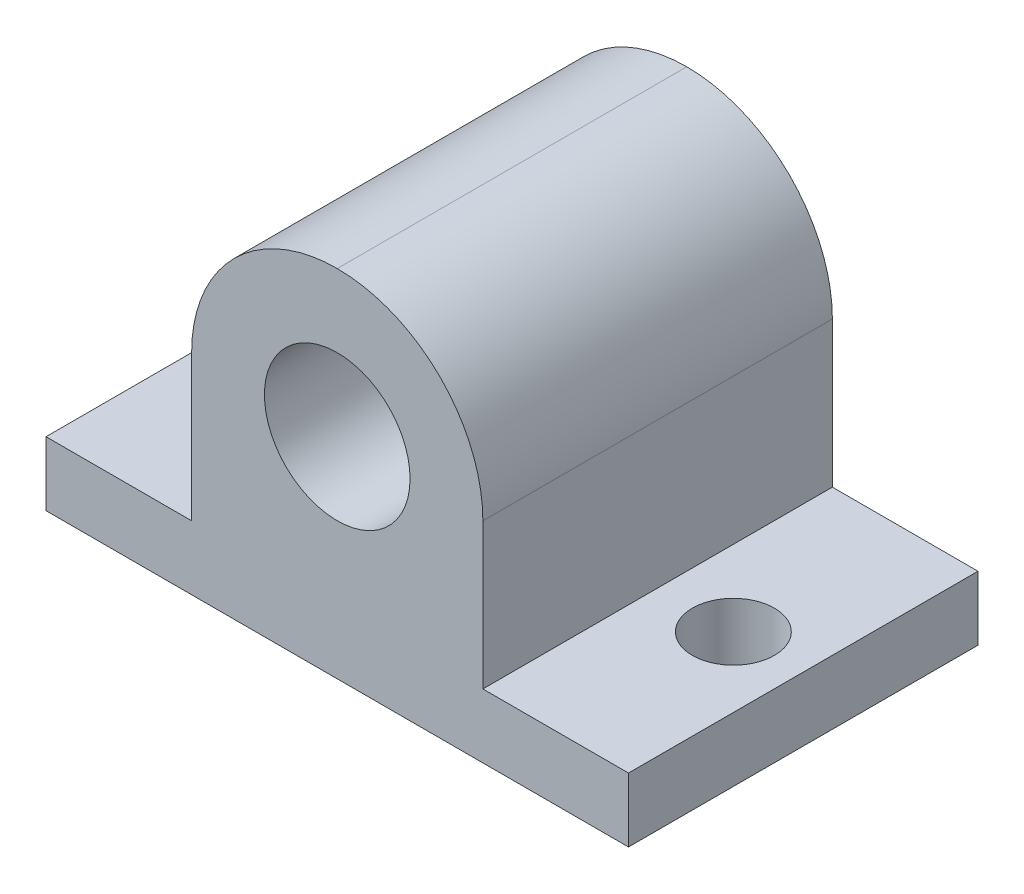
ISO-10303-21;
HEADER;
FILE_DESCRIPTION(('STEP AP214'),'2;1');
FILE_NAME('part.step','',(''),(''),'','','');
FILE_SCHEMA(('AUTOMOTIVE_DESIGN { 1 0 10303 214 1 1 1 1 }'));
ENDSEC;
DATA;
#1=APPLICATION_CONTEXT('core data for automotive mechanical design processes');
#2=APPLICATION_PROTOCOL_DEFINITION('international standard','automotive_design',2000,#1);
#3=PRODUCT_CONTEXT('',#1,'mechanical');
#4=PRODUCT('Part','Part','',(#3));
#5=PRODUCT_RELATED_PRODUCT_CATEGORY('part','',(#4));
#6=PRODUCT_DEFINITION_FORMATION('','',#4);
#7=PRODUCT_DEFINITION_CONTEXT('part definition',#1,'design');
#8=PRODUCT_DEFINITION('design','',#6,#7);
#9=PRODUCT_DEFINITION_SHAPE('','',#8);
#10=(LENGTH_UNIT() NAMED_UNIT(*) SI_UNIT(.MILLI.,.METRE.));
#11=(NAMED_UNIT(*) PLANE_ANGLE_UNIT() SI_UNIT($,.RADIAN.));
#12=(NAMED_UNIT(*) SI_UNIT($,.STERADIAN.) SOLID_ANGLE_UNIT());
#13=UNCERTAINTY_MEASURE_WITH_UNIT(LENGTH_MEASURE(1.E-05),#10,'distance_accuracy_value','');
#14=(GEOMETRIC_REPRESENTATION_CONTEXT(3) GLOBAL_UNCERTAINTY_ASSIGNED_CONTEXT((#13)) GLOBAL_UNIT_ASSIGNED_CONTEXT((#10,
#11,#12)) REPRESENTATION_CONTEXT('',''));
#15=CARTESIAN_POINT('',(0.,0.,0.));
#16=DIRECTION('',(0.,0.,1.));
#17=DIRECTION('',(1.,0.,0.));
#18=AXIS2_PLACEMENT_3D('',#15,#16,#17);
#19=CARTESIAN_POINT('',(0.,2.794,0.));
#20=DIRECTION('',(0.,-1.,0.));
#21=DIRECTION('',(0.,0.,-1.));
#22=AXIS2_PLACEMENT_3D('',#19,#20,#21);
#23=PLANE('',#22);
#24=CARTESIAN_POINT('',(3.04799999999999,2.794,-7.62));
#25=DIRECTION('',(0.,1.,0.));
#26=DIRECTION('',(0.,0.,1.));
#27=AXIS2_PLACEMENT_3D('',#24,#25,#26);
#28=CIRCLE('',#27,1.78754060407221);
#29=CARTESIAN_POINT('',(3.04799999999999,2.794,-5.83245939592779));
#30=VERTEX_POINT('',#29);
#31=EDGE_CURVE('E249',#30,#30,#28,.T.);
#32=ORIENTED_EDGE('',*,*,#31,.F.);
#33=EDGE_LOOP('',(#32));
#34=FACE_BOUND('',#33,.T.);
#35=DIRECTION('',(0.,0.,1.));
#36=VECTOR('',#35,1.);
#37=CARTESIAN_POINT('',(6.34999999999999,2.794,-15.24));
#38=LINE('',#37,#36);
#39=CARTESIAN_POINT('',(6.34999999999999,2.794,-15.24));
#40=VERTEX_POINT('',#39);
#41=CARTESIAN_POINT('',(6.34999999999999,2.794,0.));
#42=VERTEX_POINT('',#41);
#43=EDGE_CURVE('E133',#40,#42,#38,.T.);
#44=ORIENTED_EDGE('',*,*,#43,.F.);
#45=DIRECTION('',(-1.,0.,0.));
#46=VECTOR('',#45,1.);
#47=CARTESIAN_POINT('',(0.,2.794,-15.24));
#48=LINE('',#47,#46);
#49=CARTESIAN_POINT('',(0.,2.794,-15.24));
#50=VERTEX_POINT('',#49);
#51=EDGE_CURVE('E128',#40,#50,#48,.T.);
#52=ORIENTED_EDGE('',*,*,#51,.T.);
#53=DIRECTION('',(0.,0.,1.));
#54=VECTOR('',#53,1.);
#55=CARTESIAN_POINT('',(0.,2.794,0.));
#56=LINE('',#55,#54);
#57=CARTESIAN_POINT('',(0.,2.794,0.));
#58=VERTEX_POINT('',#57);
#59=EDGE_CURVE('E148',#50,#58,#56,.T.);
#60=ORIENTED_EDGE('',*,*,#59,.T.);
#61=DIRECTION('',(1.,0.,0.));
#62=VECTOR('',#61,1.);
#63=CARTESIAN_POINT('',(0.,2.794,0.));
#64=LINE('',#63,#62);
#65=EDGE_CURVE('E154',#58,#42,#64,.T.);
#66=ORIENTED_EDGE('',*,*,#65,.T.);
#67=EDGE_LOOP('',(#44,#52,#60,#66));
#68=FACE_BOUND('',#67,.T.);
#69=ADVANCED_FACE('F39',(#34,#68),#23,.F.);
#70=CARTESIAN_POINT('',(22.352,2.794,-7.62));
#71=DIRECTION('',(0.,1.,0.));
#72=DIRECTION('',(0.,0.,1.));
#73=AXIS2_PLACEMENT_3D('',#70,#71,#72);
#74=CIRCLE('',#73,1.78754060407221);
#75=CARTESIAN_POINT('',(22.352,2.794,-5.83245939592779));
#76=VERTEX_POINT('',#75);
#77=EDGE_CURVE('E241',#76,#76,#74,.T.);
#78=ORIENTED_EDGE('',*,*,#77,.F.);
#79=EDGE_LOOP('',(#78));
#80=FACE_BOUND('',#79,.T.);
#81=DIRECTION('',(0.,0.,-1.));
#82=VECTOR('',#81,1.);
#83=CARTESIAN_POINT('',(19.05,2.794,-15.24));
#84=LINE('',#83,#82);
#85=CARTESIAN_POINT('',(19.05,2.794,0.));
#86=VERTEX_POINT('',#85);
#87=CARTESIAN_POINT('',(19.05,2.794,-15.24));
#88=VERTEX_POINT('',#87);
#89=EDGE_CURVE('E121',#86,#88,#84,.T.);
#90=ORIENTED_EDGE('',*,*,#89,.F.);
#91=CARTESIAN_POINT('',(25.4,2.794,0.));
#92=VERTEX_POINT('',#91);
#93=EDGE_CURVE('E152',#86,#92,#64,.T.);
#94=ORIENTED_EDGE('',*,*,#93,.T.);
#95=DIRECTION('',(0.,0.,-1.));
#96=VECTOR('',#95,1.);
#97=CARTESIAN_POINT('',(25.4,2.794,0.));
#98=LINE('',#97,#96);
#99=CARTESIAN_POINT('',(25.4,2.794,-15.24));
#100=VERTEX_POINT('',#99);
#101=EDGE_CURVE('E124',#92,#100,#98,.T.);
#102=ORIENTED_EDGE('',*,*,#101,.T.);
#103=EDGE_CURVE('E110',#100,#88,#48,.T.);
#104=ORIENTED_EDGE('',*,*,#103,.T.);
#105=EDGE_LOOP('',(#90,#94,#102,#104));
#106=FACE_BOUND('',#105,.T.);
#107=ADVANCED_FACE('F120',(#80,#106),#23,.F.);
#108=CARTESIAN_POINT('',(0.,2.794,0.));
#109=DIRECTION('',(1.,0.,0.));
#110=DIRECTION('',(0.,0.,-1.));
#111=AXIS2_PLACEMENT_3D('',#108,#109,#110);
#112=PLANE('',#111);
#113=DIRECTION('',(0.,0.,1.));
#114=VECTOR('',#113,1.);
#115=CARTESIAN_POINT('',(0.,0.,0.));
#116=LINE('',#115,#114);
#117=CARTESIAN_POINT('',(0.,0.,-15.24));
#118=VERTEX_POINT('',#117);
#119=CARTESIAN_POINT('',(0.,0.,0.));
#120=VERTEX_POINT('',#119);
#121=EDGE_CURVE('E147',#118,#120,#116,.T.);
#122=ORIENTED_EDGE('',*,*,#121,.T.);
#123=DIRECTION('',(0.,-1.,0.));
#124=VECTOR('',#123,1.);
#125=CARTESIAN_POINT('',(0.,2.794,0.));
#126=LINE('',#125,#124);
#127=EDGE_CURVE('E181',#58,#120,#126,.T.);
#128=ORIENTED_EDGE('',*,*,#127,.F.);
#129=ORIENTED_EDGE('',*,*,#59,.F.);
#130=DIRECTION('',(0.,-1.,0.));
#131=VECTOR('',#130,1.);
#132=CARTESIAN_POINT('',(0.,2.794,-15.24));
#133=LINE('',#132,#131);
#134=EDGE_CURVE('E127',#50,#118,#133,.T.);
#135=ORIENTED_EDGE('',*,*,#134,.T.);
#136=EDGE_LOOP('',(#122,#128,#129,#135));
#137=FACE_BOUND('',#136,.T.);
#138=ADVANCED_FACE('F213',(#137),#112,.F.);
#139=CARTESIAN_POINT('',(0.,2.794,0.));
#140=DIRECTION('',(0.,0.,-1.));
#141=DIRECTION('',(-1.,0.,0.));
#142=AXIS2_PLACEMENT_3D('',#139,#140,#141);
#143=PLANE('',#142);
#144=CARTESIAN_POINT('',(12.7,9.144,0.));
#145=DIRECTION('',(0.,0.,1.));
#146=DIRECTION('',(1.,0.,0.));
#147=AXIS2_PLACEMENT_3D('',#144,#145,#146);
#148=CIRCLE('',#147,3.175);
#149=CARTESIAN_POINT('',(15.875,9.144,0.));
#150=VERTEX_POINT('',#149);
#151=EDGE_CURVE('E233',#150,#150,#148,.T.);
#152=ORIENTED_EDGE('',*,*,#151,.F.);
#153=EDGE_LOOP('',(#152));
#154=FACE_BOUND('',#153,.T.);
#155=CARTESIAN_POINT('',(12.7,9.144,0.));
#156=DIRECTION('',(0.,0.,-1.));
#157=DIRECTION('',(-1.,0.,0.));
#158=AXIS2_PLACEMENT_3D('',#155,#156,#157);
#159=CIRCLE('',#158,6.35);
#160=CARTESIAN_POINT('',(19.05,9.144,0.));
#161=VERTEX_POINT('',#160);
#162=CARTESIAN_POINT('',(12.7,15.494,0.));
#163=VERTEX_POINT('',#162);
#164=EDGE_CURVE('E185',#161,#163,#159,.F.);
#165=ORIENTED_EDGE('',*,*,#164,.T.);
#166=CARTESIAN_POINT('',(12.7,9.144,0.));
#167=DIRECTION('',(0.,0.,-1.));
#168=DIRECTION('',(-1.,0.,0.));
#169=AXIS2_PLACEMENT_3D('',#166,#167,#168);
#170=CIRCLE('',#169,6.35);
#171=CARTESIAN_POINT('',(6.34999999999999,9.144,0.));
#172=VERTEX_POINT('',#171);
#173=EDGE_CURVE('E188',#163,#172,#170,.F.);
#174=ORIENTED_EDGE('',*,*,#173,.T.);
#175=DIRECTION('',(0.,-1.,0.));
#176=VECTOR('',#175,1.);
#177=CARTESIAN_POINT('',(6.34999999999999,15.494,0.));
#178=LINE('',#177,#176);
#179=EDGE_CURVE('E144',#172,#42,#178,.T.);
#180=ORIENTED_EDGE('',*,*,#179,.T.);
#181=ORIENTED_EDGE('',*,*,#65,.F.);
#182=ORIENTED_EDGE('',*,*,#127,.T.);
#183=DIRECTION('',(1.,0.,0.));
#184=VECTOR('',#183,1.);
#185=CARTESIAN_POINT('',(0.,0.,0.));
#186=LINE('',#185,#184);
#187=CARTESIAN_POINT('',(25.4,0.,0.));
#188=VERTEX_POINT('',#187);
#189=EDGE_CURVE('E163',#120,#188,#186,.T.);
#190=ORIENTED_EDGE('',*,*,#189,.T.);
#191=DIRECTION('',(0.,-1.,0.));
#192=VECTOR('',#191,1.);
#193=CARTESIAN_POINT('',(25.4,2.794,0.));
#194=LINE('',#193,#192);
#195=EDGE_CURVE('E177',#92,#188,#194,.T.);
#196=ORIENTED_EDGE('',*,*,#195,.F.);
#197=ORIENTED_EDGE('',*,*,#93,.F.);
#198=DIRECTION('',(0.,-1.,0.));
#199=VECTOR('',#198,1.);
#200=CARTESIAN_POINT('',(19.05,15.494,0.));
#201=LINE('',#200,#199);
#202=EDGE_CURVE('E115',#161,#86,#201,.T.);
#203=ORIENTED_EDGE('',*,*,#202,.F.);
#204=EDGE_LOOP('',(#165,#174,#180,#181,#182,#190,#196,#197,#203));
#205=FACE_BOUND('',#204,.T.);
#206=ADVANCED_FACE('F202',(#154,#205),#143,.F.);
#207=CARTESIAN_POINT('',(25.4,2.794,0.));
#208=DIRECTION('',(-1.,0.,0.));
#209=DIRECTION('',(0.,0.,1.));
#210=AXIS2_PLACEMENT_3D('',#207,#208,#209);
#211=PLANE('',#210);
#212=DIRECTION('',(0.,0.,-1.));
#213=VECTOR('',#212,1.);
#214=CARTESIAN_POINT('',(25.4,0.,0.));
#215=LINE('',#214,#213);
#216=CARTESIAN_POINT('',(25.4,0.,-15.24));
#217=VERTEX_POINT('',#216);
#218=EDGE_CURVE('E166',#188,#217,#215,.T.);
#219=ORIENTED_EDGE('',*,*,#218,.T.);
#220=DIRECTION('',(0.,-1.,0.));
#221=VECTOR('',#220,1.);
#222=CARTESIAN_POINT('',(25.4,2.794,-15.24));
#223=LINE('',#222,#221);
#224=EDGE_CURVE('E174',#100,#217,#223,.T.);
#225=ORIENTED_EDGE('',*,*,#224,.F.);
#226=ORIENTED_EDGE('',*,*,#101,.F.);
#227=ORIENTED_EDGE('',*,*,#195,.T.);
#228=EDGE_LOOP('',(#219,#225,#226,#227));
#229=FACE_BOUND('',#228,.T.);
#230=ADVANCED_FACE('F205',(#229),#211,.F.);
#231=CARTESIAN_POINT('',(0.,2.794,-15.24));
#232=DIRECTION('',(0.,0.,1.));
#233=DIRECTION('',(1.,0.,0.));
#234=AXIS2_PLACEMENT_3D('',#231,#232,#233);
#235=PLANE('',#234);
#236=CARTESIAN_POINT('',(12.7,9.144,-15.24));
#237=DIRECTION('',(0.,0.,1.));
#238=DIRECTION('',(1.,0.,0.));
#239=AXIS2_PLACEMENT_3D('',#236,#237,#238);
#240=CIRCLE('',#239,3.175);
#241=CARTESIAN_POINT('',(15.875,9.144,-15.24));
#242=VERTEX_POINT('',#241);
#243=EDGE_CURVE('E230',#242,#242,#240,.T.);
#244=ORIENTED_EDGE('',*,*,#243,.T.);
#245=EDGE_LOOP('',(#244));
#246=FACE_BOUND('',#245,.T.);
#247=DIRECTION('',(0.,-1.,0.));
#248=VECTOR('',#247,1.);
#249=CARTESIAN_POINT('',(6.34999999999999,15.494,-15.24));
#250=LINE('',#249,#248);
#251=CARTESIAN_POINT('',(6.34999999999999,9.144,-15.24));
#252=VERTEX_POINT('',#251);
#253=EDGE_CURVE('E116',#252,#40,#250,.T.);
#254=ORIENTED_EDGE('',*,*,#253,.F.);
#255=CARTESIAN_POINT('',(12.7,9.144,-15.24));
#256=DIRECTION('',(0.,0.,1.));
#257=DIRECTION('',(1.,0.,0.));
#258=AXIS2_PLACEMENT_3D('',#255,#256,#257);
#259=CIRCLE('',#258,6.35);
#260=CARTESIAN_POINT('',(12.7,15.494,-15.24));
#261=VERTEX_POINT('',#260);
#262=EDGE_CURVE('E49',#252,#261,#259,.F.);
#263=ORIENTED_EDGE('',*,*,#262,.T.);
#264=CARTESIAN_POINT('',(12.7,9.144,-15.24));
#265=DIRECTION('',(0.,0.,1.));
#266=DIRECTION('',(1.,0.,0.));
#267=AXIS2_PLACEMENT_3D('',#264,#265,#266);
#268=CIRCLE('',#267,6.35);
#269=CARTESIAN_POINT('',(19.05,9.144,-15.24));
#270=VERTEX_POINT('',#269);
#271=EDGE_CURVE('E56',#261,#270,#268,.F.);
#272=ORIENTED_EDGE('',*,*,#271,.T.);
#273=DIRECTION('',(0.,-1.,0.));
#274=VECTOR('',#273,1.);
#275=CARTESIAN_POINT('',(19.05,15.494,-15.24));
#276=LINE('',#275,#274);
#277=EDGE_CURVE('E106',#270,#88,#276,.T.);
#278=ORIENTED_EDGE('',*,*,#277,.T.);
#279=ORIENTED_EDGE('',*,*,#103,.F.);
#280=ORIENTED_EDGE('',*,*,#224,.T.);
#281=DIRECTION('',(-1.,0.,0.));
#282=VECTOR('',#281,1.);
#283=CARTESIAN_POINT('',(0.,0.,-15.24));
#284=LINE('',#283,#282);
#285=EDGE_CURVE('E153',#217,#118,#284,.T.);
#286=ORIENTED_EDGE('',*,*,#285,.T.);
#287=ORIENTED_EDGE('',*,*,#134,.F.);
#288=ORIENTED_EDGE('',*,*,#51,.F.);
#289=EDGE_LOOP('',(#254,#263,#272,#278,#279,#280,#286,#287,#288));
#290=FACE_BOUND('',#289,.T.);
#291=ADVANCED_FACE('F108',(#246,#290),#235,.F.);
#292=CARTESIAN_POINT('',(0.,0.,0.));
#293=DIRECTION('',(0.,-1.,0.));
#294=DIRECTION('',(0.,0.,-1.));
#295=AXIS2_PLACEMENT_3D('',#292,#293,#294);
#296=PLANE('',#295);
#297=CARTESIAN_POINT('',(3.04799999999999,0.,-7.62));
#298=DIRECTION('',(0.,1.,0.));
#299=DIRECTION('',(0.,0.,1.));
#300=AXIS2_PLACEMENT_3D('',#297,#298,#299);
#301=CIRCLE('',#300,1.78754060407221);
#302=CARTESIAN_POINT('',(3.04799999999999,0.,-5.83245939592779));
#303=VERTEX_POINT('',#302);
#304=EDGE_CURVE('E239',#303,#303,#301,.T.);
#305=ORIENTED_EDGE('',*,*,#304,.T.);
#306=EDGE_LOOP('',(#305));
#307=FACE_BOUND('',#306,.T.);
#308=CARTESIAN_POINT('',(22.352,0.,-7.62));
#309=DIRECTION('',(0.,1.,0.));
#310=DIRECTION('',(0.,0.,1.));
#311=AXIS2_PLACEMENT_3D('',#308,#309,#310);
#312=CIRCLE('',#311,1.78754060407221);
#313=CARTESIAN_POINT('',(22.352,0.,-5.83245939592779));
#314=VERTEX_POINT('',#313);
#315=EDGE_CURVE('E245',#314,#314,#312,.T.);
#316=ORIENTED_EDGE('',*,*,#315,.T.);
#317=EDGE_LOOP('',(#316));
#318=FACE_BOUND('',#317,.T.);
#319=ORIENTED_EDGE('',*,*,#121,.F.);
#320=ORIENTED_EDGE('',*,*,#285,.F.);
#321=ORIENTED_EDGE('',*,*,#218,.F.);
#322=ORIENTED_EDGE('',*,*,#189,.F.);
#323=EDGE_LOOP('',(#319,#320,#321,#322));
#324=FACE_BOUND('',#323,.T.);
#325=ADVANCED_FACE('F210',(#307,#318,#324),#296,.T.);
#326=CARTESIAN_POINT('',(6.34999999999999,15.494,-15.24));
#327=DIRECTION('',(1.,0.,0.));
#328=DIRECTION('',(0.,0.,-1.));
#329=AXIS2_PLACEMENT_3D('',#326,#327,#328);
#330=PLANE('',#329);
#331=ORIENTED_EDGE('',*,*,#179,.F.);
#332=DIRECTION('',(0.,0.,1.));
#333=VECTOR('',#332,1.);
#334=CARTESIAN_POINT('',(6.34999999999999,9.144,-15.24));
#335=LINE('',#334,#333);
#336=EDGE_CURVE('E191',#172,#252,#335,.F.);
#337=ORIENTED_EDGE('',*,*,#336,.T.);
#338=ORIENTED_EDGE('',*,*,#253,.T.);
#339=ORIENTED_EDGE('',*,*,#43,.T.);
#340=EDGE_LOOP('',(#331,#337,#338,#339));
#341=FACE_BOUND('',#340,.T.);
#342=ADVANCED_FACE('F220',(#341),#330,.F.);
#343=CARTESIAN_POINT('',(19.05,15.494,-15.24));
#344=DIRECTION('',(-1.,0.,0.));
#345=DIRECTION('',(0.,0.,1.));
#346=AXIS2_PLACEMENT_3D('',#343,#344,#345);
#347=PLANE('',#346);
#348=ORIENTED_EDGE('',*,*,#277,.F.);
#349=DIRECTION('',(0.,0.,-1.));
#350=VECTOR('',#349,1.);
#351=CARTESIAN_POINT('',(19.05,9.144,0.));
#352=LINE('',#351,#350);
#353=EDGE_CURVE('E11',#270,#161,#352,.F.);
#354=ORIENTED_EDGE('',*,*,#353,.T.);
#355=ORIENTED_EDGE('',*,*,#202,.T.);
#356=ORIENTED_EDGE('',*,*,#89,.T.);
#357=EDGE_LOOP('',(#348,#354,#355,#356));
#358=FACE_BOUND('',#357,.T.);
#359=ADVANCED_FACE('F130',(#358),#347,.F.);
#360=CARTESIAN_POINT('',(12.7,9.144,0.));
#361=DIRECTION('',(0.,0.,1.));
#362=DIRECTION('',(1.,0.,0.));
#363=AXIS2_PLACEMENT_3D('',#360,#361,#362);
#364=CYLINDRICAL_SURFACE('',#363,6.35);
#365=ORIENTED_EDGE('',*,*,#353,.F.);
#366=ORIENTED_EDGE('',*,*,#271,.F.);
#367=DIRECTION('',(0.,0.,-1.));
#368=VECTOR('',#367,1.);
#369=CARTESIAN_POINT('',(12.7,15.494,-15.24));
#370=LINE('',#369,#368);
#371=EDGE_CURVE('E43',#163,#261,#370,.T.);
#372=ORIENTED_EDGE('',*,*,#371,.F.);
#373=ORIENTED_EDGE('',*,*,#164,.F.);
#374=EDGE_LOOP('',(#365,#366,#372,#373));
#375=FACE_BOUND('',#374,.T.);
#376=ADVANCED_FACE('F41',(#375),#364,.T.);
#377=CARTESIAN_POINT('',(12.7,9.144,0.));
#378=DIRECTION('',(0.,0.,-1.));
#379=DIRECTION('',(-1.,0.,0.));
#380=AXIS2_PLACEMENT_3D('',#377,#378,#379);
#381=CYLINDRICAL_SURFACE('',#380,6.35);
#382=ORIENTED_EDGE('',*,*,#262,.F.);
#383=ORIENTED_EDGE('',*,*,#336,.F.);
#384=ORIENTED_EDGE('',*,*,#173,.F.);
#385=ORIENTED_EDGE('',*,*,#371,.T.);
#386=EDGE_LOOP('',(#382,#383,#384,#385));
#387=FACE_BOUND('',#386,.T.);
#388=ADVANCED_FACE('F224',(#387),#381,.T.);
#389=CARTESIAN_POINT('',(12.7,9.144,-15.24));
#390=DIRECTION('',(0.,0.,1.));
#391=DIRECTION('',(1.,0.,0.));
#392=AXIS2_PLACEMENT_3D('',#389,#390,#391);
#393=CYLINDRICAL_SURFACE('',#392,3.175);
#394=CARTESIAN_POINT('',(15.875,9.144,-15.24));
#395=CARTESIAN_POINT('',(15.875,9.144,-15.08125));
#396=CARTESIAN_POINT('',(15.875,9.144,-14.9225));
#397=CARTESIAN_POINT('',(15.875,9.144,-14.605));
#398=CARTESIAN_POINT('',(15.875,9.144,-14.44625));
#399=CARTESIAN_POINT('',(15.875,9.144,-14.12875));
#400=CARTESIAN_POINT('',(15.875,9.144,-13.97));
#401=CARTESIAN_POINT('',(15.875,9.144,-13.6525));
#402=CARTESIAN_POINT('',(15.875,9.144,-13.49375));
#403=CARTESIAN_POINT('',(15.875,9.144,-13.17625));
#404=CARTESIAN_POINT('',(15.875,9.144,-13.0175));
#405=CARTESIAN_POINT('',(15.875,9.144,-12.7));
#406=CARTESIAN_POINT('',(15.875,9.144,-12.54125));
#407=CARTESIAN_POINT('',(15.875,9.144,-12.22375));
#408=CARTESIAN_POINT('',(15.875,9.144,-12.065));
#409=CARTESIAN_POINT('',(15.875,9.144,-11.7475));
#410=CARTESIAN_POINT('',(15.875,9.144,-11.58875));
#411=CARTESIAN_POINT('',(15.875,9.144,-11.27125));
#412=CARTESIAN_POINT('',(15.875,9.144,-11.1125));
#413=CARTESIAN_POINT('',(15.875,9.144,-10.795));
#414=CARTESIAN_POINT('',(15.875,9.144,-10.63625));
#415=CARTESIAN_POINT('',(15.875,9.144,-10.31875));
#416=CARTESIAN_POINT('',(15.875,9.144,-10.16));
#417=CARTESIAN_POINT('',(15.875,9.144,-9.8425));
#418=CARTESIAN_POINT('',(15.875,9.144,-9.68375));
#419=CARTESIAN_POINT('',(15.875,9.144,-9.36625));
#420=CARTESIAN_POINT('',(15.875,9.144,-9.2075));
#421=CARTESIAN_POINT('',(15.875,9.144,-8.89));
#422=CARTESIAN_POINT('',(15.875,9.144,-8.73125));
#423=CARTESIAN_POINT('',(15.875,9.144,-8.41375));
#424=CARTESIAN_POINT('',(15.875,9.144,-8.255));
#425=CARTESIAN_POINT('',(15.875,9.144,-7.9375));
#426=CARTESIAN_POINT('',(15.875,9.144,-7.77875));
#427=CARTESIAN_POINT('',(15.875,9.144,-7.46125));
#428=CARTESIAN_POINT('',(15.875,9.144,-7.3025));
#429=CARTESIAN_POINT('',(15.875,9.144,-6.985));
#430=CARTESIAN_POINT('',(15.875,9.144,-6.82625));
#431=CARTESIAN_POINT('',(15.875,9.144,-6.50875));
#432=CARTESIAN_POINT('',(15.875,9.144,-6.35));
#433=CARTESIAN_POINT('',(15.875,9.144,-6.0325));
#434=CARTESIAN_POINT('',(15.875,9.144,-5.87375));
#435=CARTESIAN_POINT('',(15.875,9.144,-5.55625));
#436=CARTESIAN_POINT('',(15.875,9.144,-5.3975));
#437=CARTESIAN_POINT('',(15.875,9.144,-5.08));
#438=CARTESIAN_POINT('',(15.875,9.144,-4.92125));
#439=CARTESIAN_POINT('',(15.875,9.144,-4.60375));
#440=CARTESIAN_POINT('',(15.875,9.144,-4.445));
#441=CARTESIAN_POINT('',(15.875,9.144,-4.1275));
#442=CARTESIAN_POINT('',(15.875,9.144,-3.96875));
#443=CARTESIAN_POINT('',(15.875,9.144,-3.65125));
#444=CARTESIAN_POINT('',(15.875,9.144,-3.4925));
#445=CARTESIAN_POINT('',(15.875,9.144,-3.175));
#446=CARTESIAN_POINT('',(15.875,9.144,-3.01625));
#447=CARTESIAN_POINT('',(15.875,9.144,-2.69875));
#448=CARTESIAN_POINT('',(15.875,9.144,-2.54));
#449=CARTESIAN_POINT('',(15.875,9.144,-2.2225));
#450=CARTESIAN_POINT('',(15.875,9.144,-2.06375));
#451=CARTESIAN_POINT('',(15.875,9.144,-1.74625));
#452=CARTESIAN_POINT('',(15.875,9.144,-1.5875));
#453=CARTESIAN_POINT('',(15.875,9.144,-1.27));
#454=CARTESIAN_POINT('',(15.875,9.144,-1.11125));
#455=CARTESIAN_POINT('',(15.875,9.144,-0.79375));
#456=CARTESIAN_POINT('',(15.875,9.144,-0.634999999999999));
#457=CARTESIAN_POINT('',(15.875,9.144,-0.3175));
#458=CARTESIAN_POINT('',(15.875,9.144,-0.15875));
#459=CARTESIAN_POINT('',(15.875,9.144,0.));
#460=B_SPLINE_CURVE_WITH_KNOTS('',3,(#394,#395,#396,#397,#398,#399,#400,#401,#402,#403,#404,
#405,#406,#407,#408,#409,#410,#411,#412,#413,#414,#415,#416,#417,#418,#419,#420,#421,#422,#423,
#424,#425,#426,#427,#428,#429,#430,#431,#432,#433,#434,#435,#436,#437,#438,#439,#440,#441,#442,
#443,#444,#445,#446,#447,#448,#449,#450,#451,#452,#453,#454,#455,#456,#457,#458,#459),
.UNSPECIFIED.,.F.,.F.,(4,2,2,2,2,2,2,2,2,2,2,2,2,2,2,2,2,2,2,2,2,2,2,2,2,2,2,2,2,2,2,2,4),(0.,
0.476250000000001,0.9525,1.42875,1.905,2.38125,2.8575,3.33375,3.81,4.28625,4.7625,5.23875,5.715,
6.19125,6.6675,7.14375,7.62,8.09625,8.5725,9.04875,9.525,10.00125,10.4775,10.95375,11.43,
11.90625,12.3825,12.85875,13.335,13.81125,14.2875,14.76375,15.24),.UNSPECIFIED.);
#461=EDGE_CURVE('BSEAM286',#242,#150,#460,.T.);
#462=ORIENTED_EDGE('',*,*,#243,.F.);
#463=ORIENTED_EDGE('',*,*,#151,.T.);
#464=ORIENTED_EDGE('',*,*,#461,.T.);
#465=ORIENTED_EDGE('',*,*,#461,.F.);
#466=EDGE_LOOP('',(#462,#464,#463,#465));
#467=FACE_BOUND('',#466,.T.);
#468=ADVANCED_FACE('F286',(#467),#393,.F.);
#469=CARTESIAN_POINT('',(22.352,0.,-7.62));
#470=DIRECTION('',(0.,1.,0.));
#471=DIRECTION('',(0.,0.,1.));
#472=AXIS2_PLACEMENT_3D('',#469,#470,#471);
#473=CYLINDRICAL_SURFACE('',#472,1.78754060407221);
#474=ORIENTED_EDGE('',*,*,#315,.F.);
#475=EDGE_LOOP('',(#474));
#476=FACE_BOUND('',#475,.T.);
#477=ORIENTED_EDGE('',*,*,#77,.T.);
#478=EDGE_LOOP('',(#477));
#479=FACE_BOUND('',#478,.T.);
#480=ADVANCED_FACE('F262',(#476,#479),#473,.F.);
#481=CARTESIAN_POINT('',(3.04799999999999,0.,-7.62));
#482=DIRECTION('',(0.,1.,0.));
#483=DIRECTION('',(0.,0.,1.));
#484=AXIS2_PLACEMENT_3D('',#481,#482,#483);
#485=CYLINDRICAL_SURFACE('',#484,1.78754060407221);
#486=ORIENTED_EDGE('',*,*,#304,.F.);
#487=EDGE_LOOP('',(#486));
#488=FACE_BOUND('',#487,.T.);
#489=ORIENTED_EDGE('',*,*,#31,.T.);
#490=EDGE_LOOP('',(#489));
#491=FACE_BOUND('',#490,.T.);
#492=ADVANCED_FACE('F259',(#488,#491),#485,.F.);
#493=CLOSED_SHELL('',(#69,#107,#138,#206,#230,#291,#325,#342,#359,#376,#388,#468,#480,#492));
#494=MANIFOLD_SOLID_BREP('B2',#493);
#495=ADVANCED_BREP_SHAPE_REPRESENTATION('',(#18,#494),#14);
#496=SHAPE_DEFINITION_REPRESENTATION(#9,#495);
ENDSEC;
END-ISO-10303-21;
